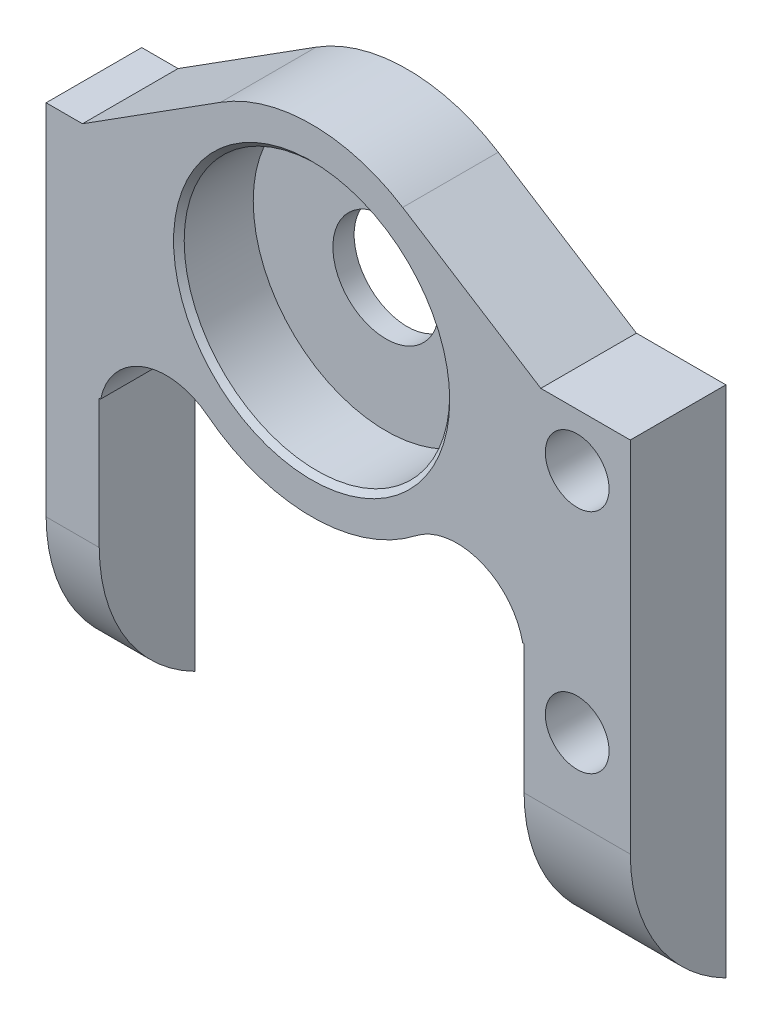
ISO-10303-21;
HEADER;
FILE_DESCRIPTION(('STEP AP214'),'2;1');
FILE_NAME('part.step','',(''),(''),'','','');
FILE_SCHEMA(('AUTOMOTIVE_DESIGN { 1 0 10303 214 1 1 1 1 }'));
ENDSEC;
DATA;
#1=APPLICATION_CONTEXT('core data for automotive mechanical design processes');
#2=APPLICATION_PROTOCOL_DEFINITION('international standard','automotive_design',2000,#1);
#3=PRODUCT_CONTEXT('',#1,'mechanical');
#4=PRODUCT('Part','Part','',(#3));
#5=PRODUCT_RELATED_PRODUCT_CATEGORY('part','',(#4));
#6=PRODUCT_DEFINITION_FORMATION('','',#4);
#7=PRODUCT_DEFINITION_CONTEXT('part definition',#1,'design');
#8=PRODUCT_DEFINITION('design','',#6,#7);
#9=PRODUCT_DEFINITION_SHAPE('','',#8);
#10=(LENGTH_UNIT() NAMED_UNIT(*) SI_UNIT(.MILLI.,.METRE.));
#11=(NAMED_UNIT(*) PLANE_ANGLE_UNIT() SI_UNIT($,.RADIAN.));
#12=(NAMED_UNIT(*) SI_UNIT($,.STERADIAN.) SOLID_ANGLE_UNIT());
#13=UNCERTAINTY_MEASURE_WITH_UNIT(LENGTH_MEASURE(1.E-05),#10,'distance_accuracy_value','');
#14=(GEOMETRIC_REPRESENTATION_CONTEXT(3) GLOBAL_UNCERTAINTY_ASSIGNED_CONTEXT((#13)) GLOBAL_UNIT_ASSIGNED_CONTEXT((#10,
#11,#12)) REPRESENTATION_CONTEXT('',''));
#15=CARTESIAN_POINT('',(0.,0.,0.));
#16=DIRECTION('',(0.,0.,1.));
#17=DIRECTION('',(1.,0.,0.));
#18=AXIS2_PLACEMENT_3D('',#15,#16,#17);
#19=CARTESIAN_POINT('',(20.4539793715245,36.3079461033165,38.4919127822395));
#20=DIRECTION('',(0.,-1.,0.));
#21=DIRECTION('',(0.,0.,-1.));
#22=AXIS2_PLACEMENT_3D('',#19,#20,#21);
#23=PLANE('',#22);
#24=DIRECTION('',(-1.,0.,0.));
#25=VECTOR('',#24,1.);
#26=CARTESIAN_POINT('',(44.4539793715245,36.3079461033165,58.9779248072098));
#27=LINE('',#26,#25);
#28=CARTESIAN_POINT('',(45.4539793715245,36.3079461033165,58.9779248072098));
#29=VERTEX_POINT('',#28);
#30=CARTESIAN_POINT('',(41.2418749984415,36.3079461033165,58.9779248072098));
#31=VERTEX_POINT('',#30);
#32=EDGE_CURVE('E245',#29,#31,#27,.T.);
#33=ORIENTED_EDGE('',*,*,#32,.F.);
#34=DIRECTION('',(0.,0.,1.));
#35=VECTOR('',#34,1.);
#36=CARTESIAN_POINT('',(45.4539793715245,36.3079461033165,54.4779248072098));
#37=LINE('',#36,#35);
#38=CARTESIAN_POINT('',(45.4539793715245,36.3079461033165,54.4779248072098));
#39=VERTEX_POINT('',#38);
#40=EDGE_CURVE('E181',#39,#29,#37,.T.);
#41=ORIENTED_EDGE('',*,*,#40,.F.);
#42=DIRECTION('',(-1.,0.,0.));
#43=VECTOR('',#42,1.);
#44=CARTESIAN_POINT('',(20.4539793715245,36.3079461033165,54.4779248072098));
#45=LINE('',#44,#43);
#46=CARTESIAN_POINT('',(41.2418749984415,36.3079461033165,54.4779248072098));
#47=VERTEX_POINT('',#46);
#48=EDGE_CURVE('E217',#39,#47,#45,.T.);
#49=ORIENTED_EDGE('',*,*,#48,.T.);
#50=DIRECTION('',(0.,0.,1.));
#51=VECTOR('',#50,1.);
#52=CARTESIAN_POINT('',(41.2418749984415,36.3079461033164,48.713060951552));
#53=LINE('',#52,#51);
#54=EDGE_CURVE('E248',#47,#31,#53,.T.);
#55=ORIENTED_EDGE('',*,*,#54,.T.);
#56=EDGE_LOOP('',(#33,#41,#49,#55));
#57=FACE_BOUND('',#56,.T.);
#58=ADVANCED_FACE('F47',(#57),#23,.F.);
#59=CARTESIAN_POINT('',(19.6660837446074,36.3079461033165,54.4779248072098));
#60=VERTEX_POINT('',#59);
#61=CARTESIAN_POINT('',(17.9539793715244,36.3079461033165,54.4779248072098));
#62=VERTEX_POINT('',#61);
#63=EDGE_CURVE('E220',#60,#62,#45,.T.);
#64=ORIENTED_EDGE('',*,*,#63,.T.);
#65=DIRECTION('',(0.,0.,-1.));
#66=VECTOR('',#65,1.);
#67=CARTESIAN_POINT('',(17.9539793715244,36.3079461033165,54.4779248072098));
#68=LINE('',#67,#66);
#69=CARTESIAN_POINT('',(17.9539793715244,36.3079461033165,58.9779248072098));
#70=VERTEX_POINT('',#69);
#71=EDGE_CURVE('E186',#70,#62,#68,.T.);
#72=ORIENTED_EDGE('',*,*,#71,.F.);
#73=DIRECTION('',(-1.,0.,0.));
#74=VECTOR('',#73,1.);
#75=CARTESIAN_POINT('',(19.6660837446074,36.3079461033165,58.9779248072098));
#76=LINE('',#75,#74);
#77=CARTESIAN_POINT('',(19.6660837446074,36.3079461033165,58.9779248072098));
#78=VERTEX_POINT('',#77);
#79=EDGE_CURVE('E250',#78,#70,#76,.T.);
#80=ORIENTED_EDGE('',*,*,#79,.F.);
#81=DIRECTION('',(0.,0.,1.));
#82=VECTOR('',#81,1.);
#83=CARTESIAN_POINT('',(19.6660837446074,36.3079461033165,48.713060951552));
#84=LINE('',#83,#82);
#85=EDGE_CURVE('E253',#60,#78,#84,.T.);
#86=ORIENTED_EDGE('',*,*,#85,.F.);
#87=EDGE_LOOP('',(#64,#72,#80,#86));
#88=FACE_BOUND('',#87,.T.);
#89=ADVANCED_FACE('F349',(#88),#23,.F.);
#90=CARTESIAN_POINT('',(40.4539793715245,26.9126796587266,47.2821640348694));
#91=DIRECTION('',(1.,0.,0.));
#92=DIRECTION('',(0.,1.,0.));
#93=AXIS2_PLACEMENT_3D('',#90,#91,#92);
#94=PLANE('',#93);
#95=DIRECTION('',(0.,1.,0.));
#96=VECTOR('',#95,1.);
#97=CARTESIAN_POINT('',(40.4539793715245,31.8046400649043,54.4779248072098));
#98=LINE('',#97,#96);
#99=CARTESIAN_POINT('',(40.4539793715245,12.1248421508215,54.4779248072098));
#100=VERTEX_POINT('',#99);
#101=CARTESIAN_POINT('',(40.4539793715245,25.509515316423,54.4779248072098));
#102=VERTEX_POINT('',#101);
#103=EDGE_CURVE('E224',#100,#102,#98,.T.);
#104=ORIENTED_EDGE('',*,*,#103,.F.);
#105=CARTESIAN_POINT('',(40.4539793715245,19.4733842545738,50.7280676166784));
#106=DIRECTION('',(1.,0.,0.));
#107=DIRECTION('',(0.,0.,-1.));
#108=AXIS2_PLACEMENT_3D('',#105,#106,#107);
#109=CIRCLE('',#108,8.25);
#110=CARTESIAN_POINT('',(40.4539793715245,19.4248421508215,58.9779248072098));
#111=VERTEX_POINT('',#110);
#112=EDGE_CURVE('E188',#100,#111,#109,.F.);
#113=ORIENTED_EDGE('',*,*,#112,.T.);
#114=DIRECTION('',(0.,1.,0.));
#115=VECTOR('',#114,1.);
#116=CARTESIAN_POINT('',(40.4539793715245,33.6779461033165,58.9779248072098));
#117=LINE('',#116,#115);
#118=CARTESIAN_POINT('',(40.4539793715245,25.509515316423,58.9779248072098));
#119=VERTEX_POINT('',#118);
#120=EDGE_CURVE('E229',#111,#119,#117,.T.);
#121=ORIENTED_EDGE('',*,*,#120,.T.);
#122=DIRECTION('',(0.,0.,1.));
#123=VECTOR('',#122,1.);
#124=CARTESIAN_POINT('',(40.4539793715245,25.509515316423,38.021715158118));
#125=LINE('',#124,#123);
#126=EDGE_CURVE('E221',#102,#119,#125,.T.);
#127=ORIENTED_EDGE('',*,*,#126,.F.);
#128=EDGE_LOOP('',(#104,#113,#121,#127));
#129=FACE_BOUND('',#128,.T.);
#130=ADVANCED_FACE('F355',(#129),#94,.F.);
#131=CARTESIAN_POINT('',(20.4539793715245,36.803053934544,44.021715158118));
#132=DIRECTION('',(1.,0.,0.));
#133=DIRECTION('',(0.,1.,0.));
#134=AXIS2_PLACEMENT_3D('',#131,#132,#133);
#135=PLANE('',#134);
#136=CARTESIAN_POINT('',(20.4539793715245,19.4733842545738,50.7280676166784));
#137=DIRECTION('',(1.,0.,0.));
#138=DIRECTION('',(0.,0.,-1.));
#139=AXIS2_PLACEMENT_3D('',#136,#137,#138);
#140=CIRCLE('',#139,8.25);
#141=CARTESIAN_POINT('',(20.4539793715245,12.1248421508215,54.4779248072098));
#142=VERTEX_POINT('',#141);
#143=CARTESIAN_POINT('',(20.4539793715245,19.4248421508215,58.9779248072098));
#144=VERTEX_POINT('',#143);
#145=EDGE_CURVE('E192',#142,#144,#140,.F.);
#146=ORIENTED_EDGE('',*,*,#145,.F.);
#147=DIRECTION('',(0.,-1.,0.));
#148=VECTOR('',#147,1.);
#149=CARTESIAN_POINT('',(20.4539793715245,31.8046400649043,54.4779248072098));
#150=LINE('',#149,#148);
#151=CARTESIAN_POINT('',(20.4539793715245,25.509515316423,54.4779248072098));
#152=VERTEX_POINT('',#151);
#153=EDGE_CURVE('E179',#152,#142,#150,.T.);
#154=ORIENTED_EDGE('',*,*,#153,.F.);
#155=DIRECTION('',(0.,0.,-1.));
#156=VECTOR('',#155,1.);
#157=CARTESIAN_POINT('',(20.4539793715245,25.509515316423,38.021715158118));
#158=LINE('',#157,#156);
#159=CARTESIAN_POINT('',(20.4539793715245,25.509515316423,58.9779248072098));
#160=VERTEX_POINT('',#159);
#161=EDGE_CURVE('E219',#160,#152,#158,.T.);
#162=ORIENTED_EDGE('',*,*,#161,.F.);
#163=DIRECTION('',(0.,-1.,0.));
#164=VECTOR('',#163,1.);
#165=CARTESIAN_POINT('',(20.4539793715245,33.6779461033165,58.9779248072098));
#166=LINE('',#165,#164);
#167=EDGE_CURVE('E232',#160,#144,#166,.T.);
#168=ORIENTED_EDGE('',*,*,#167,.T.);
#169=EDGE_LOOP('',(#146,#154,#162,#168));
#170=FACE_BOUND('',#169,.T.);
#171=ADVANCED_FACE('F343',(#170),#135,.T.);
#172=CARTESIAN_POINT('',(6.45397937152447,31.8046400649043,54.4779248072098));
#173=DIRECTION('',(0.,0.,1.));
#174=DIRECTION('',(1.,0.,0.));
#175=AXIS2_PLACEMENT_3D('',#172,#173,#174);
#176=PLANE('',#175);
#177=CARTESIAN_POINT('',(42.9539793715245,33.8079461033165,54.4779248072098));
#178=DIRECTION('',(0.,0.,1.));
#179=DIRECTION('',(1.,0.,0.));
#180=AXIS2_PLACEMENT_3D('',#177,#178,#179);
#181=CIRCLE('',#180,1.5);
#182=CARTESIAN_POINT('',(44.4539793715245,33.8079461033165,54.4779248072098));
#183=VERTEX_POINT('',#182);
#184=EDGE_CURVE('E206',#183,#183,#181,.T.);
#185=ORIENTED_EDGE('',*,*,#184,.T.);
#186=EDGE_LOOP('',(#185));
#187=FACE_BOUND('',#186,.T.);
#188=CARTESIAN_POINT('',(42.9539793715245,23.1248421508215,54.4779248072098));
#189=DIRECTION('',(0.,0.,1.));
#190=DIRECTION('',(1.,0.,0.));
#191=AXIS2_PLACEMENT_3D('',#188,#189,#190);
#192=CIRCLE('',#191,1.5);
#193=CARTESIAN_POINT('',(44.4539793715245,23.1248421508215,54.4779248072098));
#194=VERTEX_POINT('',#193);
#195=EDGE_CURVE('E203',#194,#194,#192,.T.);
#196=ORIENTED_EDGE('',*,*,#195,.T.);
#197=EDGE_LOOP('',(#196));
#198=FACE_BOUND('',#197,.T.);
#199=DIRECTION('',(-1.,0.,0.));
#200=VECTOR('',#199,1.);
#201=CARTESIAN_POINT('',(40.4539793715245,12.1248421508215,54.4779248072098));
#202=LINE('',#201,#200);
#203=CARTESIAN_POINT('',(17.9539793715244,12.1248421508215,54.4779248072098));
#204=VERTEX_POINT('',#203);
#205=EDGE_CURVE('E164',#142,#204,#202,.T.);
#206=ORIENTED_EDGE('',*,*,#205,.T.);
#207=DIRECTION('',(0.,-1.,0.));
#208=VECTOR('',#207,1.);
#209=CARTESIAN_POINT('',(17.9539793715244,36.3079461033165,54.4779248072098));
#210=LINE('',#209,#208);
#211=EDGE_CURVE('E177',#62,#204,#210,.T.);
#212=ORIENTED_EDGE('',*,*,#211,.F.);
#213=ORIENTED_EDGE('',*,*,#63,.F.);
#214=DIRECTION('',(0.844399315538351,0.535714285714282,0.));
#215=VECTOR('',#214,1.);
#216=CARTESIAN_POINT('',(21.3759952133121,37.3927693430272,54.4779248072098));
#217=LINE('',#216,#215);
#218=CARTESIAN_POINT('',(26.1682650858102,40.4331406276233,54.4779248072098));
#219=VERTEX_POINT('',#218);
#220=EDGE_CURVE('E312',#60,#219,#217,.T.);
#221=ORIENTED_EDGE('',*,*,#220,.T.);
#222=CARTESIAN_POINT('',(30.4539793715245,33.6779461033165,54.4779248072098));
#223=DIRECTION('',(0.,0.,1.));
#224=DIRECTION('',(1.,0.,0.));
#225=AXIS2_PLACEMENT_3D('',#222,#223,#224);
#226=CIRCLE('',#225,8.);
#227=CARTESIAN_POINT('',(34.7396936572388,40.4331406276233,54.4779248072098));
#228=VERTEX_POINT('',#227);
#229=EDGE_CURVE('E264',#228,#219,#226,.T.);
#230=ORIENTED_EDGE('',*,*,#229,.F.);
#231=DIRECTION('',(-0.844399315538349,0.535714285714286,0.));
#232=VECTOR('',#231,1.);
#233=CARTESIAN_POINT('',(35.5870963375758,39.8955209099667,54.4779248072098));
#234=LINE('',#233,#232);
#235=EDGE_CURVE('E278',#47,#228,#234,.T.);
#236=ORIENTED_EDGE('',*,*,#235,.F.);
#237=ORIENTED_EDGE('',*,*,#48,.F.);
#238=DIRECTION('',(0.,1.,0.));
#239=VECTOR('',#238,1.);
#240=CARTESIAN_POINT('',(45.4539793715245,12.1248421508215,54.4779248072098));
#241=LINE('',#240,#239);
#242=CARTESIAN_POINT('',(45.4539793715245,12.1248421508215,54.4779248072098));
#243=VERTEX_POINT('',#242);
#244=EDGE_CURVE('E212',#243,#39,#241,.T.);
#245=ORIENTED_EDGE('',*,*,#244,.F.);
#246=EDGE_CURVE('E180',#243,#100,#202,.T.);
#247=ORIENTED_EDGE('',*,*,#246,.T.);
#248=ORIENTED_EDGE('',*,*,#103,.T.);
#249=DIRECTION('',(-1.,0.,0.));
#250=VECTOR('',#249,1.);
#251=CARTESIAN_POINT('',(6.45397937152447,25.509515316423,54.4779248072098));
#252=LINE('',#251,#250);
#253=CARTESIAN_POINT('',(40.3879289501582,25.509515316423,54.4779248072098));
#254=VERTEX_POINT('',#253);
#255=EDGE_CURVE('E244',#102,#254,#252,.T.);
#256=ORIENTED_EDGE('',*,*,#255,.T.);
#257=CARTESIAN_POINT('',(37.2976004709454,24.8671776679955,54.4779248072098));
#258=DIRECTION('',(0.,0.,1.));
#259=DIRECTION('',(1.,0.,0.));
#260=AXIS2_PLACEMENT_3D('',#257,#258,#259);
#261=CIRCLE('',#260,3.15637890057911);
#262=CARTESIAN_POINT('',(35.3613963653005,27.3599354631535,54.4779248072098));
#263=VERTEX_POINT('',#262);
#264=EDGE_CURVE('E290',#254,#263,#261,.T.);
#265=ORIENTED_EDGE('',*,*,#264,.T.);
#266=CARTESIAN_POINT('',(30.4539793715245,33.6779461033165,54.4779248072098));
#267=DIRECTION('',(0.,0.,1.));
#268=DIRECTION('',(1.,0.,0.));
#269=AXIS2_PLACEMENT_3D('',#266,#267,#268);
#270=CIRCLE('',#269,8.);
#271=CARTESIAN_POINT('',(25.5465623781125,27.3599354628707,54.4779248072098));
#272=VERTEX_POINT('',#271);
#273=EDGE_CURVE('E276',#272,#263,#270,.T.);
#274=ORIENTED_EDGE('',*,*,#273,.F.);
#275=CARTESIAN_POINT('',(23.6103582721036,24.8671776679955,54.4779248072098));
#276=DIRECTION('',(0.,0.,-1.));
#277=DIRECTION('',(1.,0.,0.));
#278=AXIS2_PLACEMENT_3D('',#275,#276,#277);
#279=CIRCLE('',#278,3.15637890057911);
#280=CARTESIAN_POINT('',(20.5200297928908,25.509515316423,54.4779248072098));
#281=VERTEX_POINT('',#280);
#282=EDGE_CURVE('E275',#281,#272,#279,.T.);
#283=ORIENTED_EDGE('',*,*,#282,.F.);
#284=EDGE_CURVE('E237',#281,#152,#252,.T.);
#285=ORIENTED_EDGE('',*,*,#284,.T.);
#286=ORIENTED_EDGE('',*,*,#153,.T.);
#287=EDGE_LOOP('',(#206,#212,#213,#221,#230,#236,#237,#245,#247,#248,#256,#265,#274,#283,#285,#286));
#288=FACE_BOUND('',#287,.T.);
#289=CARTESIAN_POINT('',(30.4539793715245,33.6779461033165,54.4779248072098));
#290=DIRECTION('',(0.,0.,1.));
#291=DIRECTION('',(1.,0.,0.));
#292=AXIS2_PLACEMENT_3D('',#289,#290,#291);
#293=CIRCLE('',#292,2.5);
#294=CARTESIAN_POINT('',(32.9539793715245,33.6779461033165,54.4779248072098));
#295=VERTEX_POINT('',#294);
#296=EDGE_CURVE('E283',#295,#295,#293,.T.);
#297=ORIENTED_EDGE('',*,*,#296,.T.);
#298=EDGE_LOOP('',(#297));
#299=FACE_BOUND('',#298,.T.);
#300=ADVANCED_FACE('F175',(#187,#198,#288,#299),#176,.F.);
#301=CARTESIAN_POINT('',(30.4539793715245,33.6779461033165,58.4779248072098));
#302=DIRECTION('',(0.,0.,1.));
#303=DIRECTION('',(1.,0.,0.));
#304=AXIS2_PLACEMENT_3D('',#301,#302,#303);
#305=CONICAL_SURFACE('',#304,6.,0.785398163397448);
#306=CARTESIAN_POINT('',(30.4539793715245,33.6779461033165,58.9779248072098));
#307=DIRECTION('',(0.,0.,-1.));
#308=DIRECTION('',(1.,0.,0.));
#309=AXIS2_PLACEMENT_3D('',#306,#307,#308);
#310=CIRCLE('',#309,6.5);
#311=CARTESIAN_POINT('',(36.9539793715245,33.6779461033165,58.9779248072098));
#312=VERTEX_POINT('',#311);
#313=EDGE_CURVE('E270',#312,#312,#310,.T.);
#314=ORIENTED_EDGE('',*,*,#313,.F.);
#315=EDGE_LOOP('',(#314));
#316=FACE_BOUND('',#315,.T.);
#317=CARTESIAN_POINT('',(30.4539793715245,33.6779461033165,58.7279248072098));
#318=DIRECTION('',(0.,0.,1.));
#319=DIRECTION('',(1.,0.,0.));
#320=AXIS2_PLACEMENT_3D('',#317,#318,#319);
#321=CIRCLE('',#320,6.25);
#322=CARTESIAN_POINT('',(36.7039793715245,33.6779461033165,58.7279248072098));
#323=VERTEX_POINT('',#322);
#324=EDGE_CURVE('E263',#323,#323,#321,.T.);
#325=ORIENTED_EDGE('',*,*,#324,.F.);
#326=EDGE_LOOP('',(#325));
#327=FACE_BOUND('',#326,.T.);
#328=ADVANCED_FACE('F329',(#316,#327),#305,.F.);
#329=CARTESIAN_POINT('',(20.4539793715245,33.6779461033165,58.9779248072098));
#330=DIRECTION('',(0.,0.,1.));
#331=DIRECTION('',(1.,0.,0.));
#332=AXIS2_PLACEMENT_3D('',#329,#330,#331);
#333=PLANE('',#332);
#334=DIRECTION('',(1.,0.,0.));
#335=VECTOR('',#334,1.);
#336=CARTESIAN_POINT('',(17.9539793715244,19.4248421508215,58.9779248072098));
#337=LINE('',#336,#335);
#338=CARTESIAN_POINT('',(45.4539793715245,19.4248421508215,58.9779248072098));
#339=VERTEX_POINT('',#338);
#340=EDGE_CURVE('E169',#111,#339,#337,.T.);
#341=ORIENTED_EDGE('',*,*,#340,.T.);
#342=DIRECTION('',(0.,-1.,0.));
#343=VECTOR('',#342,1.);
#344=CARTESIAN_POINT('',(45.4539793715245,22.1248421508215,58.9779248072098));
#345=LINE('',#344,#343);
#346=EDGE_CURVE('E209',#29,#339,#345,.T.);
#347=ORIENTED_EDGE('',*,*,#346,.F.);
#348=ORIENTED_EDGE('',*,*,#32,.T.);
#349=DIRECTION('',(-0.844399315538349,0.535714285714286,0.));
#350=VECTOR('',#349,1.);
#351=CARTESIAN_POINT('',(44.7218365143816,34.1001457610857,58.9779248072098));
#352=LINE('',#351,#350);
#353=CARTESIAN_POINT('',(34.7396936572388,40.4331406276233,58.9779248072098));
#354=VERTEX_POINT('',#353);
#355=EDGE_CURVE('E70',#31,#354,#352,.T.);
#356=ORIENTED_EDGE('',*,*,#355,.T.);
#357=CARTESIAN_POINT('',(30.4539793715245,33.6779461033165,58.9779248072098));
#358=DIRECTION('',(0.,0.,1.));
#359=DIRECTION('',(1.,0.,0.));
#360=AXIS2_PLACEMENT_3D('',#357,#358,#359);
#361=CIRCLE('',#360,8.);
#362=CARTESIAN_POINT('',(26.1682650858102,40.4331406276233,58.9779248072098));
#363=VERTEX_POINT('',#362);
#364=EDGE_CURVE('E271',#354,#363,#361,.T.);
#365=ORIENTED_EDGE('',*,*,#364,.T.);
#366=DIRECTION('',(-0.844399315538351,-0.535714285714282,0.));
#367=VECTOR('',#366,1.);
#368=CARTESIAN_POINT('',(21.3759952133121,37.3927693430272,58.9779248072098));
#369=LINE('',#368,#367);
#370=EDGE_CURVE('E301',#363,#78,#369,.T.);
#371=ORIENTED_EDGE('',*,*,#370,.T.);
#372=ORIENTED_EDGE('',*,*,#79,.T.);
#373=DIRECTION('',(0.,1.,0.));
#374=VECTOR('',#373,1.);
#375=CARTESIAN_POINT('',(17.9539793715244,36.3079461033165,58.9779248072098));
#376=LINE('',#375,#374);
#377=CARTESIAN_POINT('',(17.9539793715244,19.4248421508215,58.9779248072098));
#378=VERTEX_POINT('',#377);
#379=EDGE_CURVE('E187',#378,#70,#376,.T.);
#380=ORIENTED_EDGE('',*,*,#379,.F.);
#381=EDGE_CURVE('E62',#378,#144,#337,.T.);
#382=ORIENTED_EDGE('',*,*,#381,.T.);
#383=ORIENTED_EDGE('',*,*,#167,.F.);
#384=DIRECTION('',(-1.,0.,0.));
#385=VECTOR('',#384,1.);
#386=CARTESIAN_POINT('',(20.4539793715245,25.509515316423,58.9779248072098));
#387=LINE('',#386,#385);
#388=CARTESIAN_POINT('',(20.5200297928908,25.509515316423,58.9779248072098));
#389=VERTEX_POINT('',#388);
#390=EDGE_CURVE('E235',#389,#160,#387,.T.);
#391=ORIENTED_EDGE('',*,*,#390,.F.);
#392=CARTESIAN_POINT('',(23.6103582721036,24.8671776679955,58.9779248072098));
#393=DIRECTION('',(0.,0.,-1.));
#394=DIRECTION('',(1.,0.,0.));
#395=AXIS2_PLACEMENT_3D('',#392,#393,#394);
#396=CIRCLE('',#395,3.15637890057911);
#397=CARTESIAN_POINT('',(25.5465654800399,27.359933053499,58.9779248072098));
#398=VERTEX_POINT('',#397);
#399=EDGE_CURVE('E282',#389,#398,#396,.T.);
#400=ORIENTED_EDGE('',*,*,#399,.T.);
#401=CARTESIAN_POINT('',(30.4539793715245,33.6779461033165,58.9779248072098));
#402=DIRECTION('',(0.,0.,1.));
#403=DIRECTION('',(1.,0.,0.));
#404=AXIS2_PLACEMENT_3D('',#401,#402,#403);
#405=CIRCLE('',#404,8.);
#406=CARTESIAN_POINT('',(35.361393263009,27.359933053499,58.9779248072098));
#407=VERTEX_POINT('',#406);
#408=EDGE_CURVE('E279',#398,#407,#405,.T.);
#409=ORIENTED_EDGE('',*,*,#408,.T.);
#410=CARTESIAN_POINT('',(37.2976004709454,24.8671776679955,58.9779248072098));
#411=DIRECTION('',(0.,0.,1.));
#412=DIRECTION('',(1.,0.,0.));
#413=AXIS2_PLACEMENT_3D('',#410,#411,#412);
#414=CIRCLE('',#413,3.15637890057911);
#415=CARTESIAN_POINT('',(40.3879289501582,25.509515316423,58.9779248072098));
#416=VERTEX_POINT('',#415);
#417=EDGE_CURVE('E285',#416,#407,#414,.T.);
#418=ORIENTED_EDGE('',*,*,#417,.F.);
#419=EDGE_CURVE('E242',#119,#416,#387,.T.);
#420=ORIENTED_EDGE('',*,*,#419,.F.);
#421=ORIENTED_EDGE('',*,*,#120,.F.);
#422=EDGE_LOOP('',(#341,#347,#348,#356,#365,#371,#372,#380,#382,#383,#391,#400,#409,#418,#420,#421));
#423=FACE_BOUND('',#422,.T.);
#424=CARTESIAN_POINT('',(42.9539793715245,33.8079461033165,58.9779248072098));
#425=DIRECTION('',(0.,0.,1.));
#426=DIRECTION('',(1.,0.,0.));
#427=AXIS2_PLACEMENT_3D('',#424,#425,#426);
#428=CIRCLE('',#427,1.5);
#429=CARTESIAN_POINT('',(44.4539793715245,33.8079461033165,58.9779248072098));
#430=VERTEX_POINT('',#429);
#431=EDGE_CURVE('E200',#430,#430,#428,.T.);
#432=ORIENTED_EDGE('',*,*,#431,.F.);
#433=EDGE_LOOP('',(#432));
#434=FACE_BOUND('',#433,.T.);
#435=CARTESIAN_POINT('',(42.9539793715245,23.1248421508215,58.9779248072098));
#436=DIRECTION('',(0.,0.,1.));
#437=DIRECTION('',(1.,0.,0.));
#438=AXIS2_PLACEMENT_3D('',#435,#436,#437);
#439=CIRCLE('',#438,1.5);
#440=CARTESIAN_POINT('',(44.4539793715245,23.1248421508215,58.9779248072098));
#441=VERTEX_POINT('',#440);
#442=EDGE_CURVE('E197',#441,#441,#439,.T.);
#443=ORIENTED_EDGE('',*,*,#442,.F.);
#444=EDGE_LOOP('',(#443));
#445=FACE_BOUND('',#444,.T.);
#446=ORIENTED_EDGE('',*,*,#313,.T.);
#447=EDGE_LOOP('',(#446));
#448=FACE_BOUND('',#447,.T.);
#449=ADVANCED_FACE('F331',(#423,#434,#445,#448),#333,.T.);
#450=CARTESIAN_POINT('',(21.3759952133121,37.3927693430272,45.1345010847596));
#451=DIRECTION('',(-0.535714285714282,0.844399315538351,0.));
#452=DIRECTION('',(-0.844399315538351,-0.535714285714282,0.));
#453=AXIS2_PLACEMENT_3D('',#450,#451,#452);
#454=PLANE('',#453);
#455=ORIENTED_EDGE('',*,*,#85,.T.);
#456=ORIENTED_EDGE('',*,*,#370,.F.);
#457=DIRECTION('',(0.,0.,1.));
#458=VECTOR('',#457,1.);
#459=CARTESIAN_POINT('',(26.1682650858102,40.4331406276233,54.4779248072098));
#460=LINE('',#459,#458);
#461=EDGE_CURVE('E268',#219,#363,#460,.T.);
#462=ORIENTED_EDGE('',*,*,#461,.F.);
#463=ORIENTED_EDGE('',*,*,#220,.F.);
#464=EDGE_LOOP('',(#455,#456,#462,#463));
#465=FACE_BOUND('',#464,.T.);
#466=ADVANCED_FACE('F339',(#465),#454,.T.);
#467=CARTESIAN_POINT('',(37.2976004709454,24.8671776679955,54.4779248072098));
#468=DIRECTION('',(0.,0.,1.));
#469=DIRECTION('',(1.,0.,0.));
#470=AXIS2_PLACEMENT_3D('',#467,#468,#469);
#471=CYLINDRICAL_SURFACE('',#470,3.15637890057911);
#472=ORIENTED_EDGE('',*,*,#264,.F.);
#473=DIRECTION('',(0.,0.,1.));
#474=VECTOR('',#473,1.);
#475=CARTESIAN_POINT('',(40.3879289501582,25.509515316423,54.4779248072098));
#476=LINE('',#475,#474);
#477=EDGE_CURVE('E255',#254,#416,#476,.T.);
#478=ORIENTED_EDGE('',*,*,#477,.T.);
#479=ORIENTED_EDGE('',*,*,#417,.T.);
#480=DIRECTION('',(0.,0.,1.));
#481=VECTOR('',#480,1.);
#482=CARTESIAN_POINT('',(35.361393263009,27.359933053499,56.4779248072099));
#483=LINE('',#482,#481);
#484=EDGE_CURVE('E291',#263,#407,#483,.T.);
#485=ORIENTED_EDGE('',*,*,#484,.F.);
#486=EDGE_LOOP('',(#472,#478,#479,#485));
#487=FACE_BOUND('',#486,.T.);
#488=ADVANCED_FACE('F379',(#487),#471,.F.);
#489=CARTESIAN_POINT('',(38.5700508000959,38.0030379462775,54.4779248072098));
#490=DIRECTION('',(0.535714285714286,0.844399315538349,0.));
#491=DIRECTION('',(0.,0.,-1.));
#492=AXIS2_PLACEMENT_3D('',#489,#490,#491);
#493=PLANE('',#492);
#494=ORIENTED_EDGE('',*,*,#54,.F.);
#495=ORIENTED_EDGE('',*,*,#235,.T.);
#496=DIRECTION('',(0.,0.,1.));
#497=VECTOR('',#496,1.);
#498=CARTESIAN_POINT('',(34.7396936572388,40.4331406276233,54.4779248072098));
#499=LINE('',#498,#497);
#500=EDGE_CURVE('E267',#228,#354,#499,.T.);
#501=ORIENTED_EDGE('',*,*,#500,.T.);
#502=ORIENTED_EDGE('',*,*,#355,.F.);
#503=EDGE_LOOP('',(#494,#495,#501,#502));
#504=FACE_BOUND('',#503,.T.);
#505=ADVANCED_FACE('F369',(#504),#493,.T.);
#506=CARTESIAN_POINT('',(30.4539793715245,33.6779461033165,54.4779248072098));
#507=DIRECTION('',(0.,0.,1.));
#508=DIRECTION('',(1.,0.,0.));
#509=AXIS2_PLACEMENT_3D('',#506,#507,#508);
#510=CYLINDRICAL_SURFACE('',#509,8.);
#511=ORIENTED_EDGE('',*,*,#364,.F.);
#512=ORIENTED_EDGE('',*,*,#500,.F.);
#513=ORIENTED_EDGE('',*,*,#229,.T.);
#514=ORIENTED_EDGE('',*,*,#461,.T.);
#515=EDGE_LOOP('',(#511,#512,#513,#514));
#516=FACE_BOUND('',#515,.T.);
#517=ADVANCED_FACE('F375',(#516),#510,.T.);
#518=CARTESIAN_POINT('',(23.6103582721036,24.8671776679955,54.4779248072098));
#519=DIRECTION('',(0.,0.,1.));
#520=DIRECTION('',(1.,0.,0.));
#521=AXIS2_PLACEMENT_3D('',#518,#519,#520);
#522=CYLINDRICAL_SURFACE('',#521,3.15637890057911);
#523=ORIENTED_EDGE('',*,*,#399,.F.);
#524=DIRECTION('',(0.,0.,1.));
#525=VECTOR('',#524,1.);
#526=CARTESIAN_POINT('',(20.5200297928908,25.509515316423,54.4779248072098));
#527=LINE('',#526,#525);
#528=EDGE_CURVE('E13',#389,#281,#527,.F.);
#529=ORIENTED_EDGE('',*,*,#528,.T.);
#530=ORIENTED_EDGE('',*,*,#282,.T.);
#531=DIRECTION('',(0.,0.,1.));
#532=VECTOR('',#531,1.);
#533=CARTESIAN_POINT('',(25.5465654800399,27.359933053499,56.4779248072099));
#534=LINE('',#533,#532);
#535=EDGE_CURVE('E272',#272,#398,#534,.T.);
#536=ORIENTED_EDGE('',*,*,#535,.T.);
#537=EDGE_LOOP('',(#523,#529,#530,#536));
#538=FACE_BOUND('',#537,.T.);
#539=ADVANCED_FACE('F413',(#538),#522,.F.);
#540=CARTESIAN_POINT('',(30.4539793715245,33.6779461033165,54.4779248072098));
#541=DIRECTION('',(0.,0.,1.));
#542=DIRECTION('',(1.,0.,0.));
#543=AXIS2_PLACEMENT_3D('',#540,#541,#542);
#544=CYLINDRICAL_SURFACE('',#543,8.);
#545=ORIENTED_EDGE('',*,*,#408,.F.);
#546=ORIENTED_EDGE('',*,*,#535,.F.);
#547=ORIENTED_EDGE('',*,*,#273,.T.);
#548=ORIENTED_EDGE('',*,*,#484,.T.);
#549=EDGE_LOOP('',(#545,#546,#547,#548));
#550=FACE_BOUND('',#549,.T.);
#551=ADVANCED_FACE('F408',(#550),#544,.T.);
#552=CARTESIAN_POINT('',(30.4539793715245,33.6779461033165,45.7779248072098));
#553=DIRECTION('',(0.,0.,1.));
#554=DIRECTION('',(1.,0.,0.));
#555=AXIS2_PLACEMENT_3D('',#552,#553,#554);
#556=CYLINDRICAL_SURFACE('',#555,2.5);
#557=ORIENTED_EDGE('',*,*,#296,.F.);
#558=EDGE_LOOP('',(#557));
#559=FACE_BOUND('',#558,.T.);
#560=CARTESIAN_POINT('',(30.4539793715245,33.6779461033165,55.4779248072099));
#561=DIRECTION('',(0.,0.,1.));
#562=DIRECTION('',(1.,0.,0.));
#563=AXIS2_PLACEMENT_3D('',#560,#561,#562);
#564=CIRCLE('',#563,2.5);
#565=CARTESIAN_POINT('',(32.9539793715245,33.6779461033165,55.4779248072099));
#566=VERTEX_POINT('',#565);
#567=EDGE_CURVE('E258',#566,#566,#564,.T.);
#568=ORIENTED_EDGE('',*,*,#567,.T.);
#569=EDGE_LOOP('',(#568));
#570=FACE_BOUND('',#569,.T.);
#571=ADVANCED_FACE('F325',(#559,#570),#556,.F.);
#572=CARTESIAN_POINT('',(30.4539793715245,33.6779461033165,65.2779248072099));
#573=DIRECTION('',(0.,0.,-1.));
#574=DIRECTION('',(-1.,0.,0.));
#575=AXIS2_PLACEMENT_3D('',#572,#573,#574);
#576=CYLINDRICAL_SURFACE('',#575,6.25);
#577=CARTESIAN_POINT('',(30.4539793715245,33.6779461033165,55.4779248072099));
#578=DIRECTION('',(0.,0.,1.));
#579=DIRECTION('',(1.,0.,0.));
#580=AXIS2_PLACEMENT_3D('',#577,#578,#579);
#581=CIRCLE('',#580,6.25);
#582=CARTESIAN_POINT('',(36.7039793715245,33.6779461033165,55.4779248072099));
#583=VERTEX_POINT('',#582);
#584=EDGE_CURVE('E55',#583,#583,#581,.T.);
#585=ORIENTED_EDGE('',*,*,#584,.F.);
#586=EDGE_LOOP('',(#585));
#587=FACE_BOUND('',#586,.T.);
#588=ORIENTED_EDGE('',*,*,#324,.T.);
#589=EDGE_LOOP('',(#588));
#590=FACE_BOUND('',#589,.T.);
#591=ADVANCED_FACE('F322',(#587,#590),#576,.F.);
#592=CARTESIAN_POINT('',(30.4539793715245,33.6779461033165,55.4779248072099));
#593=DIRECTION('',(0.,0.,1.));
#594=DIRECTION('',(1.,0.,0.));
#595=AXIS2_PLACEMENT_3D('',#592,#593,#594);
#596=PLANE('',#595);
#597=ORIENTED_EDGE('',*,*,#584,.T.);
#598=EDGE_LOOP('',(#597));
#599=FACE_BOUND('',#598,.T.);
#600=ORIENTED_EDGE('',*,*,#567,.F.);
#601=EDGE_LOOP('',(#600));
#602=FACE_BOUND('',#601,.T.);
#603=ADVANCED_FACE('F319',(#599,#602),#596,.T.);
#604=CARTESIAN_POINT('',(-28.7897424955555,25.509515316423,50.8537295765763));
#605=DIRECTION('',(0.,1.,0.));
#606=DIRECTION('',(0.,0.,1.));
#607=AXIS2_PLACEMENT_3D('',#604,#605,#606);
#608=PLANE('',#607);
#609=ORIENTED_EDGE('',*,*,#126,.T.);
#610=ORIENTED_EDGE('',*,*,#419,.T.);
#611=ORIENTED_EDGE('',*,*,#477,.F.);
#612=ORIENTED_EDGE('',*,*,#255,.F.);
#613=EDGE_LOOP('',(#609,#610,#611,#612));
#614=FACE_BOUND('',#613,.T.);
#615=ADVANCED_FACE('F418',(#614),#608,.F.);
#616=ORIENTED_EDGE('',*,*,#528,.F.);
#617=ORIENTED_EDGE('',*,*,#390,.T.);
#618=ORIENTED_EDGE('',*,*,#161,.T.);
#619=ORIENTED_EDGE('',*,*,#284,.F.);
#620=EDGE_LOOP('',(#616,#617,#618,#619));
#621=FACE_BOUND('',#620,.T.);
#622=ADVANCED_FACE('F416',(#621),#608,.F.);
#623=CARTESIAN_POINT('',(45.4539793715245,0.,0.));
#624=DIRECTION('',(1.,0.,0.));
#625=DIRECTION('',(0.,0.,-1.));
#626=AXIS2_PLACEMENT_3D('',#623,#624,#625);
#627=PLANE('',#626);
#628=CARTESIAN_POINT('',(45.4539793715245,19.4733842545738,50.7280676166784));
#629=DIRECTION('',(-1.,0.,0.));
#630=DIRECTION('',(0.,0.,-1.));
#631=AXIS2_PLACEMENT_3D('',#628,#629,#630);
#632=CIRCLE('',#631,8.25);
#633=EDGE_CURVE('E170',#243,#339,#632,.T.);
#634=ORIENTED_EDGE('',*,*,#633,.F.);
#635=ORIENTED_EDGE('',*,*,#244,.T.);
#636=ORIENTED_EDGE('',*,*,#40,.T.);
#637=ORIENTED_EDGE('',*,*,#346,.T.);
#638=EDGE_LOOP('',(#634,#635,#636,#637));
#639=FACE_BOUND('',#638,.T.);
#640=ADVANCED_FACE('F364',(#639),#627,.T.);
#641=CARTESIAN_POINT('',(42.9539793715245,23.1248421508215,54.4778998072098));
#642=DIRECTION('',(0.,0.,1.));
#643=DIRECTION('',(1.,0.,0.));
#644=AXIS2_PLACEMENT_3D('',#641,#642,#643);
#645=CYLINDRICAL_SURFACE('',#644,1.5);
#646=ORIENTED_EDGE('',*,*,#442,.T.);
#647=EDGE_LOOP('',(#646));
#648=FACE_BOUND('',#647,.T.);
#649=ORIENTED_EDGE('',*,*,#195,.F.);
#650=EDGE_LOOP('',(#649));
#651=FACE_BOUND('',#650,.T.);
#652=ADVANCED_FACE('F598',(#648,#651),#645,.F.);
#653=CARTESIAN_POINT('',(42.9539793715245,33.8079461033165,54.4778998072098));
#654=DIRECTION('',(0.,0.,1.));
#655=DIRECTION('',(1.,0.,0.));
#656=AXIS2_PLACEMENT_3D('',#653,#654,#655);
#657=CYLINDRICAL_SURFACE('',#656,1.5);
#658=ORIENTED_EDGE('',*,*,#431,.T.);
#659=EDGE_LOOP('',(#658));
#660=FACE_BOUND('',#659,.T.);
#661=ORIENTED_EDGE('',*,*,#184,.F.);
#662=EDGE_LOOP('',(#661));
#663=FACE_BOUND('',#662,.T.);
#664=ADVANCED_FACE('F606',(#660,#663),#657,.F.);
#665=CARTESIAN_POINT('',(17.9539793715244,0.,0.));
#666=DIRECTION('',(-1.,0.,0.));
#667=DIRECTION('',(0.,0.,1.));
#668=AXIS2_PLACEMENT_3D('',#665,#666,#667);
#669=PLANE('',#668);
#670=CARTESIAN_POINT('',(17.9539793715244,19.4733842545738,50.7280676166784));
#671=DIRECTION('',(-1.,0.,0.));
#672=DIRECTION('',(0.,0.,-1.));
#673=AXIS2_PLACEMENT_3D('',#670,#671,#672);
#674=CIRCLE('',#673,8.25);
#675=EDGE_CURVE('E161',#204,#378,#674,.T.);
#676=ORIENTED_EDGE('',*,*,#675,.T.);
#677=ORIENTED_EDGE('',*,*,#379,.T.);
#678=ORIENTED_EDGE('',*,*,#71,.T.);
#679=ORIENTED_EDGE('',*,*,#211,.T.);
#680=EDGE_LOOP('',(#676,#677,#678,#679));
#681=FACE_BOUND('',#680,.T.);
#682=ADVANCED_FACE('F184',(#681),#669,.T.);
#683=CARTESIAN_POINT('',(17.9539793715244,19.4733842545738,50.7280676166784));
#684=DIRECTION('',(1.,0.,0.));
#685=DIRECTION('',(0.,0.,-1.));
#686=AXIS2_PLACEMENT_3D('',#683,#684,#685);
#687=CYLINDRICAL_SURFACE('',#686,8.25);
#688=ORIENTED_EDGE('',*,*,#145,.T.);
#689=ORIENTED_EDGE('',*,*,#381,.F.);
#690=ORIENTED_EDGE('',*,*,#675,.F.);
#691=ORIENTED_EDGE('',*,*,#205,.F.);
#692=EDGE_LOOP('',(#688,#689,#690,#691));
#693=FACE_BOUND('',#692,.T.);
#694=ADVANCED_FACE('F163',(#693),#687,.T.);
#695=ORIENTED_EDGE('',*,*,#246,.F.);
#696=ORIENTED_EDGE('',*,*,#633,.T.);
#697=ORIENTED_EDGE('',*,*,#340,.F.);
#698=ORIENTED_EDGE('',*,*,#112,.F.);
#699=EDGE_LOOP('',(#695,#696,#697,#698));
#700=FACE_BOUND('',#699,.T.);
#701=ADVANCED_FACE('F398',(#700),#687,.T.);
#702=CLOSED_SHELL('',(#58,#89,#130,#171,#300,#328,#449,#466,#488,#505,#517,#539,#551,#571,#591,
#603,#615,#622,#640,#652,#664,#682,#694,#701));
#703=MANIFOLD_SOLID_BREP('B2',#702);
#704=ADVANCED_BREP_SHAPE_REPRESENTATION('',(#18,#703),#14);
#705=SHAPE_DEFINITION_REPRESENTATION(#9,#704);
ENDSEC;
END-ISO-10303-21;
